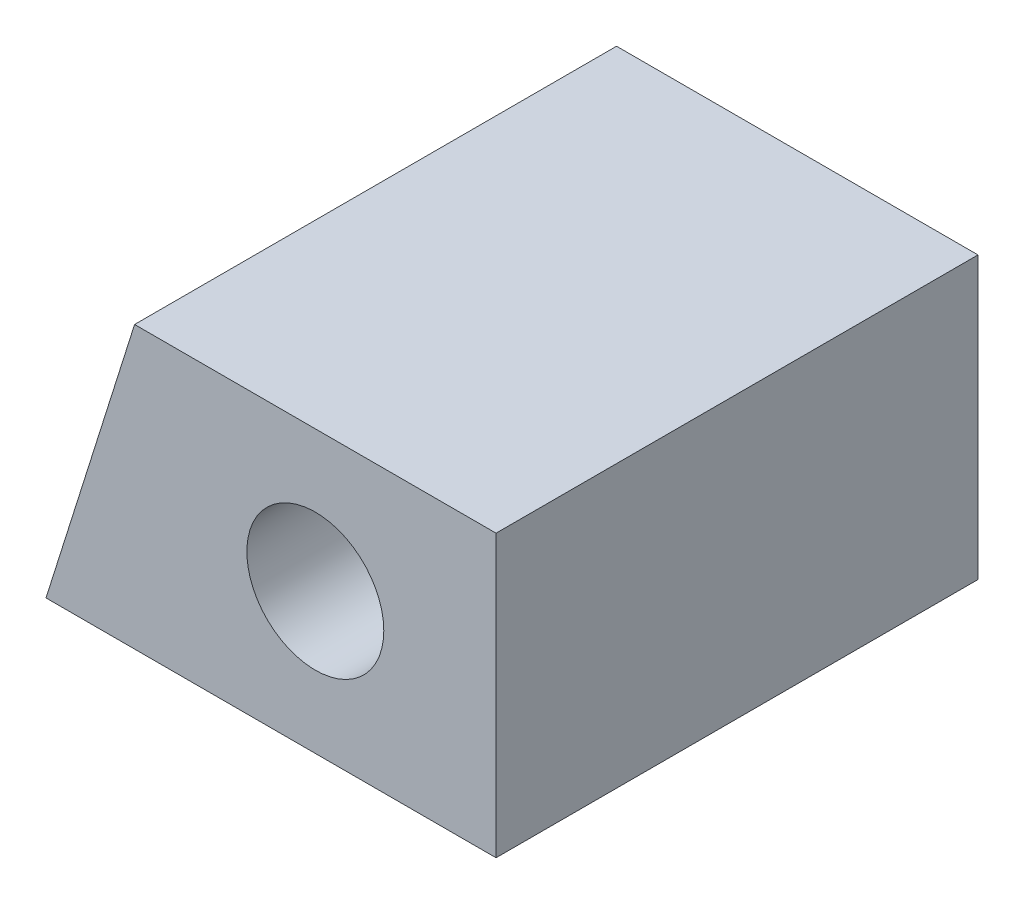
ISO-10303-21;
HEADER;
FILE_DESCRIPTION(('STEP AP214'),'2;1');
FILE_NAME('part.step','',(''),(''),'','','');
FILE_SCHEMA(('AUTOMOTIVE_DESIGN { 1 0 10303 214 1 1 1 1 }'));
ENDSEC;
DATA;
#1=APPLICATION_CONTEXT('core data for automotive mechanical design processes');
#2=APPLICATION_PROTOCOL_DEFINITION('international standard','automotive_design',2000,#1);
#3=PRODUCT_CONTEXT('',#1,'mechanical');
#4=PRODUCT('Part','Part','',(#3));
#5=PRODUCT_RELATED_PRODUCT_CATEGORY('part','',(#4));
#6=PRODUCT_DEFINITION_FORMATION('','',#4);
#7=PRODUCT_DEFINITION_CONTEXT('part definition',#1,'design');
#8=PRODUCT_DEFINITION('design','',#6,#7);
#9=PRODUCT_DEFINITION_SHAPE('','',#8);
#10=(LENGTH_UNIT() NAMED_UNIT(*) SI_UNIT(.MILLI.,.METRE.));
#11=(NAMED_UNIT(*) PLANE_ANGLE_UNIT() SI_UNIT($,.RADIAN.));
#12=(NAMED_UNIT(*) SI_UNIT($,.STERADIAN.) SOLID_ANGLE_UNIT());
#13=UNCERTAINTY_MEASURE_WITH_UNIT(LENGTH_MEASURE(1.E-05),#10,'distance_accuracy_value','');
#14=(GEOMETRIC_REPRESENTATION_CONTEXT(3) GLOBAL_UNCERTAINTY_ASSIGNED_CONTEXT((#13)) GLOBAL_UNIT_ASSIGNED_CONTEXT((#10,
#11,#12)) REPRESENTATION_CONTEXT('',''));
#15=CARTESIAN_POINT('',(0.,0.,0.));
#16=DIRECTION('',(0.,0.,1.));
#17=DIRECTION('',(1.,0.,0.));
#18=AXIS2_PLACEMENT_3D('',#15,#16,#17);
#19=CARTESIAN_POINT('',(0.,0.,12.));
#20=DIRECTION('',(0.,0.,-1.));
#21=DIRECTION('',(-1.,0.,0.));
#22=AXIS2_PLACEMENT_3D('',#19,#20,#21);
#23=PLANE('',#22);
#24=DIRECTION('',(-1.,0.,0.));
#25=VECTOR('',#24,1.);
#26=CARTESIAN_POINT('',(5.60287420464197,3.5,12.));
#27=LINE('',#26,#25);
#28=CARTESIAN_POINT('',(5.60287420464197,3.5,12.));
#29=VERTEX_POINT('',#28);
#30=CARTESIAN_POINT('',(-3.39712579535803,3.5,12.));
#31=VERTEX_POINT('',#30);
#32=EDGE_CURVE('E92',#29,#31,#27,.T.);
#33=ORIENTED_EDGE('',*,*,#32,.T.);
#34=DIRECTION('',(-0.300539339915884,-0.953769419284831,0.));
#35=VECTOR('',#34,1.);
#36=CARTESIAN_POINT('',(-3.39712579535803,3.5,12.));
#37=LINE('',#36,#35);
#38=CARTESIAN_POINT('',(-5.60287420464198,-3.5,12.));
#39=VERTEX_POINT('',#38);
#40=EDGE_CURVE('E87',#31,#39,#37,.T.);
#41=ORIENTED_EDGE('',*,*,#40,.T.);
#42=DIRECTION('',(1.,0.,0.));
#43=VECTOR('',#42,1.);
#44=CARTESIAN_POINT('',(-5.60287420464198,-3.5,12.));
#45=LINE('',#44,#43);
#46=CARTESIAN_POINT('',(5.60287420464197,-3.5,12.));
#47=VERTEX_POINT('',#46);
#48=EDGE_CURVE('E90',#39,#47,#45,.T.);
#49=ORIENTED_EDGE('',*,*,#48,.T.);
#50=DIRECTION('',(0.,1.,0.));
#51=VECTOR('',#50,1.);
#52=CARTESIAN_POINT('',(5.60287420464197,-3.5,12.));
#53=LINE('',#52,#51);
#54=EDGE_CURVE('E57',#47,#29,#53,.T.);
#55=ORIENTED_EDGE('',*,*,#54,.T.);
#56=EDGE_LOOP('',(#33,#41,#49,#55));
#57=FACE_BOUND('',#56,.T.);
#58=CARTESIAN_POINT('',(1.10287420464197,0.,12.));
#59=DIRECTION('',(0.,0.,1.));
#60=DIRECTION('',(1.,0.,0.));
#61=AXIS2_PLACEMENT_3D('',#58,#59,#60);
#62=CIRCLE('',#61,1.705);
#63=CARTESIAN_POINT('',(2.80787420464197,0.,12.));
#64=VERTEX_POINT('',#63);
#65=EDGE_CURVE('E112',#64,#64,#62,.T.);
#66=ORIENTED_EDGE('',*,*,#65,.F.);
#67=EDGE_LOOP('',(#66));
#68=FACE_BOUND('',#67,.T.);
#69=ADVANCED_FACE('F39',(#57,#68),#23,.F.);
#70=CARTESIAN_POINT('',(0.,0.,0.));
#71=DIRECTION('',(0.,0.,-1.));
#72=DIRECTION('',(-1.,0.,0.));
#73=AXIS2_PLACEMENT_3D('',#70,#71,#72);
#74=PLANE('',#73);
#75=DIRECTION('',(-1.,0.,0.));
#76=VECTOR('',#75,1.);
#77=CARTESIAN_POINT('',(5.60287420464197,3.5,0.));
#78=LINE('',#77,#76);
#79=CARTESIAN_POINT('',(5.60287420464197,3.5,0.));
#80=VERTEX_POINT('',#79);
#81=CARTESIAN_POINT('',(-3.39712579535803,3.5,0.));
#82=VERTEX_POINT('',#81);
#83=EDGE_CURVE('E108',#80,#82,#78,.T.);
#84=ORIENTED_EDGE('',*,*,#83,.F.);
#85=DIRECTION('',(0.,1.,0.));
#86=VECTOR('',#85,1.);
#87=CARTESIAN_POINT('',(5.60287420464197,-3.5,0.));
#88=LINE('',#87,#86);
#89=CARTESIAN_POINT('',(5.60287420464197,-3.5,0.));
#90=VERTEX_POINT('',#89);
#91=EDGE_CURVE('E80',#90,#80,#88,.T.);
#92=ORIENTED_EDGE('',*,*,#91,.F.);
#93=DIRECTION('',(1.,0.,0.));
#94=VECTOR('',#93,1.);
#95=CARTESIAN_POINT('',(-5.60287420464198,-3.5,0.));
#96=LINE('',#95,#94);
#97=CARTESIAN_POINT('',(-5.60287420464198,-3.5,0.));
#98=VERTEX_POINT('',#97);
#99=EDGE_CURVE('E74',#98,#90,#96,.T.);
#100=ORIENTED_EDGE('',*,*,#99,.F.);
#101=DIRECTION('',(-0.300539339915884,-0.953769419284831,0.));
#102=VECTOR('',#101,1.);
#103=CARTESIAN_POINT('',(-3.39712579535803,3.5,0.));
#104=LINE('',#103,#102);
#105=EDGE_CURVE('E97',#82,#98,#104,.T.);
#106=ORIENTED_EDGE('',*,*,#105,.F.);
#107=EDGE_LOOP('',(#84,#92,#100,#106));
#108=FACE_BOUND('',#107,.T.);
#109=CARTESIAN_POINT('',(1.10287420464197,0.,0.));
#110=DIRECTION('',(0.,0.,1.));
#111=DIRECTION('',(1.,0.,0.));
#112=AXIS2_PLACEMENT_3D('',#109,#110,#111);
#113=CIRCLE('',#112,1.705);
#114=CARTESIAN_POINT('',(2.80787420464197,0.,0.));
#115=VERTEX_POINT('',#114);
#116=EDGE_CURVE('E130',#115,#115,#113,.T.);
#117=ORIENTED_EDGE('',*,*,#116,.T.);
#118=EDGE_LOOP('',(#117));
#119=FACE_BOUND('',#118,.T.);
#120=ADVANCED_FACE('F125',(#108,#119),#74,.T.);
#121=CARTESIAN_POINT('',(5.60287420464197,3.5,12.));
#122=DIRECTION('',(0.,-1.,0.));
#123=DIRECTION('',(0.,0.,-1.));
#124=AXIS2_PLACEMENT_3D('',#121,#122,#123);
#125=PLANE('',#124);
#126=ORIENTED_EDGE('',*,*,#83,.T.);
#127=DIRECTION('',(0.,0.,-1.));
#128=VECTOR('',#127,1.);
#129=CARTESIAN_POINT('',(-3.39712579535803,3.5,12.));
#130=LINE('',#129,#128);
#131=EDGE_CURVE('E11',#31,#82,#130,.T.);
#132=ORIENTED_EDGE('',*,*,#131,.F.);
#133=ORIENTED_EDGE('',*,*,#32,.F.);
#134=DIRECTION('',(0.,0.,-1.));
#135=VECTOR('',#134,1.);
#136=CARTESIAN_POINT('',(5.60287420464197,3.5,12.));
#137=LINE('',#136,#135);
#138=EDGE_CURVE('E104',#29,#80,#137,.T.);
#139=ORIENTED_EDGE('',*,*,#138,.T.);
#140=EDGE_LOOP('',(#126,#132,#133,#139));
#141=FACE_BOUND('',#140,.T.);
#142=ADVANCED_FACE('F41',(#141),#125,.F.);
#143=CARTESIAN_POINT('',(-3.39712579535803,3.5,12.));
#144=DIRECTION('',(0.953769419284831,-0.300539339915884,0.));
#145=DIRECTION('',(0.300539339915884,0.953769419284831,0.));
#146=AXIS2_PLACEMENT_3D('',#143,#144,#145);
#147=PLANE('',#146);
#148=ORIENTED_EDGE('',*,*,#105,.T.);
#149=DIRECTION('',(0.,0.,-1.));
#150=VECTOR('',#149,1.);
#151=CARTESIAN_POINT('',(-5.60287420464198,-3.5,12.));
#152=LINE('',#151,#150);
#153=EDGE_CURVE('E49',#39,#98,#152,.T.);
#154=ORIENTED_EDGE('',*,*,#153,.F.);
#155=ORIENTED_EDGE('',*,*,#40,.F.);
#156=ORIENTED_EDGE('',*,*,#131,.T.);
#157=EDGE_LOOP('',(#148,#154,#155,#156));
#158=FACE_BOUND('',#157,.T.);
#159=ADVANCED_FACE('F96',(#158),#147,.F.);
#160=CARTESIAN_POINT('',(-5.60287420464198,-3.5,12.));
#161=DIRECTION('',(0.,1.,0.));
#162=DIRECTION('',(-1.,0.,0.));
#163=AXIS2_PLACEMENT_3D('',#160,#161,#162);
#164=PLANE('',#163);
#165=ORIENTED_EDGE('',*,*,#99,.T.);
#166=DIRECTION('',(0.,0.,-1.));
#167=VECTOR('',#166,1.);
#168=CARTESIAN_POINT('',(5.60287420464197,-3.5,12.));
#169=LINE('',#168,#167);
#170=EDGE_CURVE('E99',#47,#90,#169,.T.);
#171=ORIENTED_EDGE('',*,*,#170,.F.);
#172=ORIENTED_EDGE('',*,*,#48,.F.);
#173=ORIENTED_EDGE('',*,*,#153,.T.);
#174=EDGE_LOOP('',(#165,#171,#172,#173));
#175=FACE_BOUND('',#174,.T.);
#176=ADVANCED_FACE('F100',(#175),#164,.F.);
#177=CARTESIAN_POINT('',(5.60287420464197,-3.5,12.));
#178=DIRECTION('',(-1.,0.,0.));
#179=DIRECTION('',(0.,0.,1.));
#180=AXIS2_PLACEMENT_3D('',#177,#178,#179);
#181=PLANE('',#180);
#182=ORIENTED_EDGE('',*,*,#91,.T.);
#183=ORIENTED_EDGE('',*,*,#138,.F.);
#184=ORIENTED_EDGE('',*,*,#54,.F.);
#185=ORIENTED_EDGE('',*,*,#170,.T.);
#186=EDGE_LOOP('',(#182,#183,#184,#185));
#187=FACE_BOUND('',#186,.T.);
#188=ADVANCED_FACE('F122',(#187),#181,.F.);
#189=CARTESIAN_POINT('',(1.10287420464197,0.,12.));
#190=DIRECTION('',(0.,0.,-1.));
#191=DIRECTION('',(-1.,0.,0.));
#192=AXIS2_PLACEMENT_3D('',#189,#190,#191);
#193=CYLINDRICAL_SURFACE('',#192,1.705);
#194=ORIENTED_EDGE('',*,*,#65,.T.);
#195=EDGE_LOOP('',(#194));
#196=FACE_BOUND('',#195,.T.);
#197=ORIENTED_EDGE('',*,*,#116,.F.);
#198=EDGE_LOOP('',(#197));
#199=FACE_BOUND('',#198,.T.);
#200=ADVANCED_FACE('F138',(#196,#199),#193,.F.);
#201=CLOSED_SHELL('',(#69,#120,#142,#159,#176,#188,#200));
#202=MANIFOLD_SOLID_BREP('B2',#201);
#203=ADVANCED_BREP_SHAPE_REPRESENTATION('',(#18,#202),#14);
#204=SHAPE_DEFINITION_REPRESENTATION(#9,#203);
ENDSEC;
END-ISO-10303-21;
